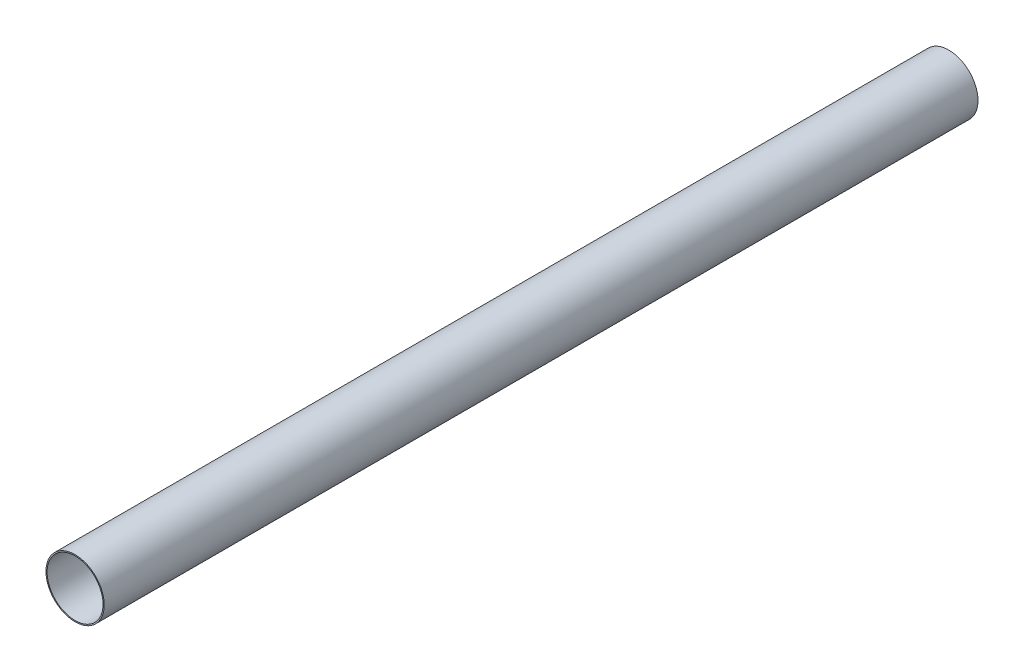
ISO-10303-21;
HEADER;
FILE_DESCRIPTION(('STEP AP214'),'2;1');
FILE_NAME('part.step','',(''),(''),'','','');
FILE_SCHEMA(('AUTOMOTIVE_DESIGN { 1 0 10303 214 1 1 1 1 }'));
ENDSEC;
DATA;
#1=APPLICATION_CONTEXT('core data for automotive mechanical design processes');
#2=APPLICATION_PROTOCOL_DEFINITION('international standard','automotive_design',2000,#1);
#3=PRODUCT_CONTEXT('',#1,'mechanical');
#4=PRODUCT('Part','Part','',(#3));
#5=PRODUCT_RELATED_PRODUCT_CATEGORY('part','',(#4));
#6=PRODUCT_DEFINITION_FORMATION('','',#4);
#7=PRODUCT_DEFINITION_CONTEXT('part definition',#1,'design');
#8=PRODUCT_DEFINITION('design','',#6,#7);
#9=PRODUCT_DEFINITION_SHAPE('','',#8);
#10=(LENGTH_UNIT() NAMED_UNIT(*) SI_UNIT(.MILLI.,.METRE.));
#11=(NAMED_UNIT(*) PLANE_ANGLE_UNIT() SI_UNIT($,.RADIAN.));
#12=(NAMED_UNIT(*) SI_UNIT($,.STERADIAN.) SOLID_ANGLE_UNIT());
#13=UNCERTAINTY_MEASURE_WITH_UNIT(LENGTH_MEASURE(1.E-05),#10,'distance_accuracy_value','');
#14=(GEOMETRIC_REPRESENTATION_CONTEXT(3) GLOBAL_UNCERTAINTY_ASSIGNED_CONTEXT((#13)) GLOBAL_UNIT_ASSIGNED_CONTEXT((#10,
#11,#12)) REPRESENTATION_CONTEXT('',''));
#15=CARTESIAN_POINT('',(0.,0.,0.));
#16=DIRECTION('',(0.,0.,1.));
#17=DIRECTION('',(1.,0.,0.));
#18=AXIS2_PLACEMENT_3D('',#15,#16,#17);
#19=CARTESIAN_POINT('',(0.,0.,1524.));
#20=DIRECTION('',(0.,0.,1.));
#21=DIRECTION('',(1.,0.,0.));
#22=AXIS2_PLACEMENT_3D('',#19,#20,#21);
#23=PLANE('',#22);
#24=CARTESIAN_POINT('',(0.,0.,1524.));
#25=DIRECTION('',(0.,0.,1.));
#26=DIRECTION('',(1.,0.,0.));
#27=AXIS2_PLACEMENT_3D('',#24,#25,#26);
#28=CIRCLE('',#27,50.8);
#29=CARTESIAN_POINT('',(50.8,0.,1524.));
#30=VERTEX_POINT('',#29);
#31=EDGE_CURVE('E10',#30,#30,#28,.T.);
#32=ORIENTED_EDGE('',*,*,#31,.T.);
#33=EDGE_LOOP('',(#32));
#34=FACE_BOUND('',#33,.T.);
#35=CARTESIAN_POINT('',(0.,0.,1524.));
#36=DIRECTION('',(0.,0.,1.));
#37=DIRECTION('',(1.,0.,0.));
#38=AXIS2_PLACEMENT_3D('',#35,#36,#37);
#39=CIRCLE('',#38,48.8061);
#40=CARTESIAN_POINT('',(48.8061,0.,1524.));
#41=VERTEX_POINT('',#40);
#42=EDGE_CURVE('E51',#41,#41,#39,.T.);
#43=ORIENTED_EDGE('',*,*,#42,.F.);
#44=EDGE_LOOP('',(#43));
#45=FACE_BOUND('',#44,.T.);
#46=ADVANCED_FACE('F38',(#34,#45),#23,.T.);
#47=CARTESIAN_POINT('',(0.,0.,0.));
#48=DIRECTION('',(0.,0.,1.));
#49=DIRECTION('',(1.,0.,0.));
#50=AXIS2_PLACEMENT_3D('',#47,#48,#49);
#51=PLANE('',#50);
#52=CARTESIAN_POINT('',(0.,0.,0.));
#53=DIRECTION('',(0.,0.,1.));
#54=DIRECTION('',(1.,0.,0.));
#55=AXIS2_PLACEMENT_3D('',#52,#53,#54);
#56=CIRCLE('',#55,50.8);
#57=CARTESIAN_POINT('',(50.8,0.,0.));
#58=VERTEX_POINT('',#57);
#59=EDGE_CURVE('E42',#58,#58,#56,.T.);
#60=ORIENTED_EDGE('',*,*,#59,.F.);
#61=EDGE_LOOP('',(#60));
#62=FACE_BOUND('',#61,.T.);
#63=CARTESIAN_POINT('',(0.,0.,0.));
#64=DIRECTION('',(0.,0.,1.));
#65=DIRECTION('',(1.,0.,0.));
#66=AXIS2_PLACEMENT_3D('',#63,#64,#65);
#67=CIRCLE('',#66,48.8061);
#68=CARTESIAN_POINT('',(48.8061,0.,0.));
#69=VERTEX_POINT('',#68);
#70=EDGE_CURVE('E53',#69,#69,#67,.T.);
#71=ORIENTED_EDGE('',*,*,#70,.T.);
#72=EDGE_LOOP('',(#71));
#73=FACE_BOUND('',#72,.T.);
#74=ADVANCED_FACE('F65',(#62,#73),#51,.F.);
#75=CARTESIAN_POINT('',(0.,0.,1524.));
#76=DIRECTION('',(0.,0.,-1.));
#77=DIRECTION('',(-1.,0.,0.));
#78=AXIS2_PLACEMENT_3D('',#75,#76,#77);
#79=CYLINDRICAL_SURFACE('',#78,50.8);
#80=ORIENTED_EDGE('',*,*,#31,.F.);
#81=EDGE_LOOP('',(#80));
#82=FACE_BOUND('',#81,.T.);
#83=ORIENTED_EDGE('',*,*,#59,.T.);
#84=EDGE_LOOP('',(#83));
#85=FACE_BOUND('',#84,.T.);
#86=ADVANCED_FACE('F40',(#82,#85),#79,.T.);
#87=CARTESIAN_POINT('',(0.,0.,1524.));
#88=DIRECTION('',(0.,0.,-1.));
#89=DIRECTION('',(-1.,0.,0.));
#90=AXIS2_PLACEMENT_3D('',#87,#88,#89);
#91=CYLINDRICAL_SURFACE('',#90,48.8061);
#92=ORIENTED_EDGE('',*,*,#42,.T.);
#93=EDGE_LOOP('',(#92));
#94=FACE_BOUND('',#93,.T.);
#95=ORIENTED_EDGE('',*,*,#70,.F.);
#96=EDGE_LOOP('',(#95));
#97=FACE_BOUND('',#96,.T.);
#98=ADVANCED_FACE('F61',(#94,#97),#91,.F.);
#99=CLOSED_SHELL('',(#46,#74,#86,#98));
#100=MANIFOLD_SOLID_BREP('B2',#99);
#101=ADVANCED_BREP_SHAPE_REPRESENTATION('',(#18,#100),#14);
#102=SHAPE_DEFINITION_REPRESENTATION(#9,#101);
ENDSEC;
END-ISO-10303-21;
